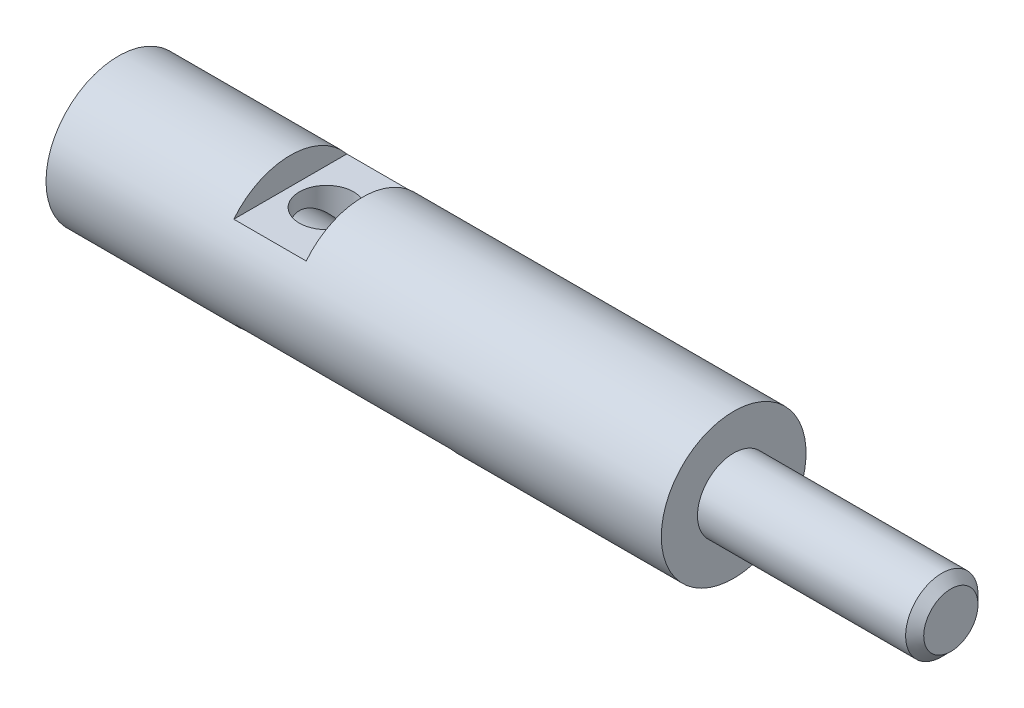
ISO-10303-21;
HEADER;
FILE_DESCRIPTION(('STEP AP214'),'2;1');
FILE_NAME('part.step','',(''),(''),'','','');
FILE_SCHEMA(('AUTOMOTIVE_DESIGN { 1 0 10303 214 1 1 1 1 }'));
ENDSEC;
DATA;
#1=APPLICATION_CONTEXT('core data for automotive mechanical design processes');
#2=APPLICATION_PROTOCOL_DEFINITION('international standard','automotive_design',2000,#1);
#3=PRODUCT_CONTEXT('',#1,'mechanical');
#4=PRODUCT('Part','Part','',(#3));
#5=PRODUCT_RELATED_PRODUCT_CATEGORY('part','',(#4));
#6=PRODUCT_DEFINITION_FORMATION('','',#4);
#7=PRODUCT_DEFINITION_CONTEXT('part definition',#1,'design');
#8=PRODUCT_DEFINITION('design','',#6,#7);
#9=PRODUCT_DEFINITION_SHAPE('','',#8);
#10=(LENGTH_UNIT() NAMED_UNIT(*) SI_UNIT(.MILLI.,.METRE.));
#11=(NAMED_UNIT(*) PLANE_ANGLE_UNIT() SI_UNIT($,.RADIAN.));
#12=(NAMED_UNIT(*) SI_UNIT($,.STERADIAN.) SOLID_ANGLE_UNIT());
#13=UNCERTAINTY_MEASURE_WITH_UNIT(LENGTH_MEASURE(1.E-05),#10,'distance_accuracy_value','');
#14=(GEOMETRIC_REPRESENTATION_CONTEXT(3) GLOBAL_UNCERTAINTY_ASSIGNED_CONTEXT((#13)) GLOBAL_UNIT_ASSIGNED_CONTEXT((#10,
#11,#12)) REPRESENTATION_CONTEXT('',''));
#15=CARTESIAN_POINT('',(0.,0.,0.));
#16=DIRECTION('',(0.,0.,1.));
#17=DIRECTION('',(1.,0.,0.));
#18=AXIS2_PLACEMENT_3D('',#15,#16,#17);
#19=CARTESIAN_POINT('',(0.,0.,0.));
#20=DIRECTION('',(-1.,0.,0.));
#21=DIRECTION('',(0.,0.,1.));
#22=AXIS2_PLACEMENT_3D('',#19,#20,#21);
#23=CYLINDRICAL_SURFACE('',#22,4.);
#24=CARTESIAN_POINT('',(9.5,0.,0.));
#25=DIRECTION('',(1.,0.,0.));
#26=DIRECTION('',(0.,0.,-1.));
#27=AXIS2_PLACEMENT_3D('',#24,#25,#26);
#28=CIRCLE('',#27,4.);
#29=CARTESIAN_POINT('',(9.5,2.5,-3.1224989991992));
#30=VERTEX_POINT('',#29);
#31=CARTESIAN_POINT('',(9.5,2.5,3.1224989991992));
#32=VERTEX_POINT('',#31);
#33=EDGE_CURVE('E126',#30,#32,#28,.T.);
#34=ORIENTED_EDGE('',*,*,#33,.F.);
#35=DIRECTION('',(-1.,0.,0.));
#36=VECTOR('',#35,1.);
#37=CARTESIAN_POINT('',(0.,2.5,-3.1224989991992));
#38=LINE('',#37,#36);
#39=CARTESIAN_POINT('',(13.5,2.5,-3.1224989991992));
#40=VERTEX_POINT('',#39);
#41=EDGE_CURVE('E124',#40,#30,#38,.T.);
#42=ORIENTED_EDGE('',*,*,#41,.F.);
#43=CARTESIAN_POINT('',(13.5,0.,0.));
#44=DIRECTION('',(-1.,0.,0.));
#45=DIRECTION('',(0.,0.,1.));
#46=AXIS2_PLACEMENT_3D('',#43,#44,#45);
#47=CIRCLE('',#46,4.);
#48=CARTESIAN_POINT('',(13.5,2.5,3.1224989991992));
#49=VERTEX_POINT('',#48);
#50=EDGE_CURVE('E120',#49,#40,#47,.T.);
#51=ORIENTED_EDGE('',*,*,#50,.F.);
#52=DIRECTION('',(-1.,0.,0.));
#53=VECTOR('',#52,1.);
#54=CARTESIAN_POINT('',(0.,2.5,3.1224989991992));
#55=LINE('',#54,#53);
#56=EDGE_CURVE('E122',#32,#49,#55,.F.);
#57=ORIENTED_EDGE('',*,*,#56,.F.);
#58=EDGE_LOOP('',(#34,#42,#51,#57));
#59=FACE_BOUND('',#58,.T.);
#60=CARTESIAN_POINT('',(0.,0.,0.));
#61=DIRECTION('',(-1.,0.,0.));
#62=DIRECTION('',(0.,0.,1.));
#63=AXIS2_PLACEMENT_3D('',#60,#61,#62);
#64=CIRCLE('',#63,4.);
#65=CARTESIAN_POINT('',(0.,0.,4.));
#66=VERTEX_POINT('',#65);
#67=EDGE_CURVE('E117',#66,#66,#64,.T.);
#68=ORIENTED_EDGE('',*,*,#67,.F.);
#69=EDGE_LOOP('',(#68));
#70=FACE_BOUND('',#69,.T.);
#71=CARTESIAN_POINT('',(34.,0.,0.));
#72=DIRECTION('',(-1.,0.,0.));
#73=DIRECTION('',(0.,0.,1.));
#74=AXIS2_PLACEMENT_3D('',#71,#72,#73);
#75=CIRCLE('',#74,4.);
#76=CARTESIAN_POINT('',(34.,0.,4.));
#77=VERTEX_POINT('',#76);
#78=EDGE_CURVE('E114',#77,#77,#75,.T.);
#79=ORIENTED_EDGE('',*,*,#78,.T.);
#80=EDGE_LOOP('',(#79));
#81=FACE_BOUND('',#80,.T.);
#82=DIRECTION('',(-1.,0.,0.));
#83=VECTOR('',#82,1.);
#84=CARTESIAN_POINT('',(0.,-2.5,3.1224989991992));
#85=LINE('',#84,#83);
#86=CARTESIAN_POINT('',(21.5,-2.5,3.1224989991992));
#87=VERTEX_POINT('',#86);
#88=CARTESIAN_POINT('',(9.5,-2.5,3.1224989991992));
#89=VERTEX_POINT('',#88);
#90=EDGE_CURVE('E11',#87,#89,#85,.T.);
#91=ORIENTED_EDGE('',*,*,#90,.F.);
#92=CARTESIAN_POINT('',(21.5,0.,0.));
#93=DIRECTION('',(-1.,0.,0.));
#94=DIRECTION('',(0.,0.,1.));
#95=AXIS2_PLACEMENT_3D('',#92,#93,#94);
#96=CIRCLE('',#95,4.);
#97=CARTESIAN_POINT('',(21.5,-2.5,-3.1224989991992));
#98=VERTEX_POINT('',#97);
#99=EDGE_CURVE('E130',#98,#87,#96,.T.);
#100=ORIENTED_EDGE('',*,*,#99,.F.);
#101=DIRECTION('',(-1.,0.,0.));
#102=VECTOR('',#101,1.);
#103=CARTESIAN_POINT('',(0.,-2.5,-3.1224989991992));
#104=LINE('',#103,#102);
#105=CARTESIAN_POINT('',(9.5,-2.5,-3.1224989991992));
#106=VERTEX_POINT('',#105);
#107=EDGE_CURVE('E128',#106,#98,#104,.F.);
#108=ORIENTED_EDGE('',*,*,#107,.F.);
#109=CARTESIAN_POINT('',(9.5,0.,0.));
#110=DIRECTION('',(1.,0.,0.));
#111=DIRECTION('',(0.,0.,-1.));
#112=AXIS2_PLACEMENT_3D('',#109,#110,#111);
#113=CIRCLE('',#112,4.);
#114=EDGE_CURVE('E47',#89,#106,#113,.T.);
#115=ORIENTED_EDGE('',*,*,#114,.F.);
#116=EDGE_LOOP('',(#91,#100,#108,#115));
#117=FACE_BOUND('',#116,.T.);
#118=ADVANCED_FACE('F39',(#59,#70,#81,#117),#23,.T.);
#119=CARTESIAN_POINT('',(0.,0.,0.));
#120=DIRECTION('',(1.,0.,0.));
#121=DIRECTION('',(0.,0.,-1.));
#122=AXIS2_PLACEMENT_3D('',#119,#120,#121);
#123=PLANE('',#122);
#124=CARTESIAN_POINT('',(0.,0.,0.));
#125=DIRECTION('',(-1.,0.,0.));
#126=DIRECTION('',(0.,0.,1.));
#127=AXIS2_PLACEMENT_3D('',#124,#125,#126);
#128=CIRCLE('',#127,1.6);
#129=CARTESIAN_POINT('',(0.,0.,1.6));
#130=VERTEX_POINT('',#129);
#131=EDGE_CURVE('E90',#130,#130,#128,.T.);
#132=ORIENTED_EDGE('',*,*,#131,.F.);
#133=EDGE_LOOP('',(#132));
#134=FACE_BOUND('',#133,.T.);
#135=ORIENTED_EDGE('',*,*,#67,.T.);
#136=EDGE_LOOP('',(#135));
#137=FACE_BOUND('',#136,.T.);
#138=ADVANCED_FACE('F41',(#134,#137),#123,.F.);
#139=CARTESIAN_POINT('',(34.,4.,0.));
#140=DIRECTION('',(-1.,0.,0.));
#141=DIRECTION('',(0.,0.,1.));
#142=AXIS2_PLACEMENT_3D('',#139,#140,#141);
#143=PLANE('',#142);
#144=ORIENTED_EDGE('',*,*,#78,.F.);
#145=EDGE_LOOP('',(#144));
#146=FACE_BOUND('',#145,.T.);
#147=CARTESIAN_POINT('',(34.,0.,0.));
#148=DIRECTION('',(-1.,0.,0.));
#149=DIRECTION('',(0.,0.,1.));
#150=AXIS2_PLACEMENT_3D('',#147,#148,#149);
#151=CIRCLE('',#150,2.);
#152=CARTESIAN_POINT('',(34.,0.,2.));
#153=VERTEX_POINT('',#152);
#154=EDGE_CURVE('E111',#153,#153,#151,.T.);
#155=ORIENTED_EDGE('',*,*,#154,.T.);
#156=EDGE_LOOP('',(#155));
#157=FACE_BOUND('',#156,.T.);
#158=ADVANCED_FACE('F157',(#146,#157),#143,.F.);
#159=CARTESIAN_POINT('',(0.,0.,0.));
#160=DIRECTION('',(-1.,0.,0.));
#161=DIRECTION('',(0.,0.,1.));
#162=AXIS2_PLACEMENT_3D('',#159,#160,#161);
#163=CYLINDRICAL_SURFACE('',#162,2.);
#164=ORIENTED_EDGE('',*,*,#154,.F.);
#165=EDGE_LOOP('',(#164));
#166=FACE_BOUND('',#165,.T.);
#167=CARTESIAN_POINT('',(45.5,0.,0.));
#168=DIRECTION('',(-1.,0.,0.));
#169=DIRECTION('',(0.,0.,1.));
#170=AXIS2_PLACEMENT_3D('',#167,#168,#169);
#171=CIRCLE('',#170,2.);
#172=CARTESIAN_POINT('',(45.5,0.,2.));
#173=VERTEX_POINT('',#172);
#174=EDGE_CURVE('E108',#173,#173,#171,.T.);
#175=ORIENTED_EDGE('',*,*,#174,.T.);
#176=EDGE_LOOP('',(#175));
#177=FACE_BOUND('',#176,.T.);
#178=ADVANCED_FACE('F164',(#166,#177),#163,.T.);
#179=CARTESIAN_POINT('',(46.,0.,0.));
#180=DIRECTION('',(-1.,0.,0.));
#181=DIRECTION('',(0.,0.,1.));
#182=AXIS2_PLACEMENT_3D('',#179,#180,#181);
#183=CONICAL_SURFACE('',#182,1.5,0.785398163397448);
#184=ORIENTED_EDGE('',*,*,#174,.F.);
#185=EDGE_LOOP('',(#184));
#186=FACE_BOUND('',#185,.T.);
#187=CARTESIAN_POINT('',(46.,0.,0.));
#188=DIRECTION('',(-1.,0.,0.));
#189=DIRECTION('',(0.,0.,1.));
#190=AXIS2_PLACEMENT_3D('',#187,#188,#189);
#191=CIRCLE('',#190,1.5);
#192=CARTESIAN_POINT('',(46.,0.,1.5));
#193=VERTEX_POINT('',#192);
#194=EDGE_CURVE('E102',#193,#193,#191,.T.);
#195=ORIENTED_EDGE('',*,*,#194,.T.);
#196=EDGE_LOOP('',(#195));
#197=FACE_BOUND('',#196,.T.);
#198=ADVANCED_FACE('F168',(#186,#197),#183,.T.);
#199=CARTESIAN_POINT('',(46.,1.5,0.));
#200=DIRECTION('',(-1.,0.,0.));
#201=DIRECTION('',(0.,0.,1.));
#202=AXIS2_PLACEMENT_3D('',#199,#200,#201);
#203=PLANE('',#202);
#204=ORIENTED_EDGE('',*,*,#194,.F.);
#205=EDGE_LOOP('',(#204));
#206=FACE_BOUND('',#205,.T.);
#207=ADVANCED_FACE('F172',(#206),#203,.F.);
#208=CARTESIAN_POINT('',(9.5,2.5,4.));
#209=DIRECTION('',(1.,0.,0.));
#210=DIRECTION('',(0.,0.,-1.));
#211=AXIS2_PLACEMENT_3D('',#208,#209,#210);
#212=PLANE('',#211);
#213=ORIENTED_EDGE('',*,*,#33,.T.);
#214=DIRECTION('',(0.,0.,-1.));
#215=VECTOR('',#214,1.);
#216=CARTESIAN_POINT('',(9.5,2.5,4.));
#217=LINE('',#216,#215);
#218=EDGE_CURVE('E92',#32,#30,#217,.T.);
#219=ORIENTED_EDGE('',*,*,#218,.T.);
#220=EDGE_LOOP('',(#213,#219));
#221=FACE_BOUND('',#220,.T.);
#222=ADVANCED_FACE('F175',(#221),#212,.T.);
#223=CARTESIAN_POINT('',(9.5,2.5,4.));
#224=DIRECTION('',(0.,1.,0.));
#225=DIRECTION('',(0.,0.,1.));
#226=AXIS2_PLACEMENT_3D('',#223,#224,#225);
#227=PLANE('',#226);
#228=CARTESIAN_POINT('',(11.5,2.5,0.));
#229=DIRECTION('',(0.,1.,0.));
#230=DIRECTION('',(0.,0.,1.));
#231=AXIS2_PLACEMENT_3D('',#228,#229,#230);
#232=CIRCLE('',#231,1.5);
#233=CARTESIAN_POINT('',(11.5,2.5,1.5));
#234=VERTEX_POINT('',#233);
#235=EDGE_CURVE('E234',#234,#234,#232,.T.);
#236=ORIENTED_EDGE('',*,*,#235,.F.);
#237=EDGE_LOOP('',(#236));
#238=FACE_BOUND('',#237,.T.);
#239=ORIENTED_EDGE('',*,*,#41,.T.);
#240=ORIENTED_EDGE('',*,*,#218,.F.);
#241=ORIENTED_EDGE('',*,*,#56,.T.);
#242=DIRECTION('',(0.,0.,-1.));
#243=VECTOR('',#242,1.);
#244=CARTESIAN_POINT('',(13.5,2.5,4.));
#245=LINE('',#244,#243);
#246=EDGE_CURVE('E60',#49,#40,#245,.T.);
#247=ORIENTED_EDGE('',*,*,#246,.T.);
#248=EDGE_LOOP('',(#239,#240,#241,#247));
#249=FACE_BOUND('',#248,.T.);
#250=ADVANCED_FACE('F178',(#238,#249),#227,.T.);
#251=CARTESIAN_POINT('',(13.5,2.5,4.));
#252=DIRECTION('',(-1.,0.,0.));
#253=DIRECTION('',(0.,0.,1.));
#254=AXIS2_PLACEMENT_3D('',#251,#252,#253);
#255=PLANE('',#254);
#256=ORIENTED_EDGE('',*,*,#50,.T.);
#257=ORIENTED_EDGE('',*,*,#246,.F.);
#258=EDGE_LOOP('',(#256,#257));
#259=FACE_BOUND('',#258,.T.);
#260=ADVANCED_FACE('F148',(#259),#255,.T.);
#261=CARTESIAN_POINT('',(9.5,-2.5,4.));
#262=DIRECTION('',(1.,0.,0.));
#263=DIRECTION('',(0.,0.,-1.));
#264=AXIS2_PLACEMENT_3D('',#261,#262,#263);
#265=PLANE('',#264);
#266=ORIENTED_EDGE('',*,*,#114,.T.);
#267=DIRECTION('',(0.,0.,-1.));
#268=VECTOR('',#267,1.);
#269=CARTESIAN_POINT('',(9.5,-2.5,4.));
#270=LINE('',#269,#268);
#271=EDGE_CURVE('E53',#89,#106,#270,.T.);
#272=ORIENTED_EDGE('',*,*,#271,.F.);
#273=EDGE_LOOP('',(#266,#272));
#274=FACE_BOUND('',#273,.T.);
#275=ADVANCED_FACE('F134',(#274),#265,.T.);
#276=CARTESIAN_POINT('',(21.5,-2.5,4.));
#277=DIRECTION('',(-1.,0.,0.));
#278=DIRECTION('',(0.,0.,1.));
#279=AXIS2_PLACEMENT_3D('',#276,#277,#278);
#280=PLANE('',#279);
#281=ORIENTED_EDGE('',*,*,#99,.T.);
#282=DIRECTION('',(0.,0.,-1.));
#283=VECTOR('',#282,1.);
#284=CARTESIAN_POINT('',(21.5,-2.5,4.));
#285=LINE('',#284,#283);
#286=EDGE_CURVE('E100',#87,#98,#285,.T.);
#287=ORIENTED_EDGE('',*,*,#286,.T.);
#288=EDGE_LOOP('',(#281,#287));
#289=FACE_BOUND('',#288,.T.);
#290=ADVANCED_FACE('F140',(#289),#280,.T.);
#291=CARTESIAN_POINT('',(9.5,-2.5,4.));
#292=DIRECTION('',(0.,-1.,0.));
#293=DIRECTION('',(0.,0.,-1.));
#294=AXIS2_PLACEMENT_3D('',#291,#292,#293);
#295=PLANE('',#294);
#296=ORIENTED_EDGE('',*,*,#90,.T.);
#297=ORIENTED_EDGE('',*,*,#271,.T.);
#298=ORIENTED_EDGE('',*,*,#107,.T.);
#299=ORIENTED_EDGE('',*,*,#286,.F.);
#300=EDGE_LOOP('',(#296,#297,#298,#299));
#301=FACE_BOUND('',#300,.T.);
#302=ADVANCED_FACE('F84',(#301),#295,.T.);
#303=CARTESIAN_POINT('',(14.,0.,0.));
#304=DIRECTION('',(-1.,0.,0.));
#305=DIRECTION('',(0.,0.,1.));
#306=AXIS2_PLACEMENT_3D('',#303,#304,#305);
#307=CONICAL_SURFACE('',#306,1.6,1.02974425867665);
#308=CARTESIAN_POINT('',(14.9613769904441,0.,0.));
#309=VERTEX_POINT('',#308);
#310=VERTEX_LOOP('',#309);
#311=FACE_BOUND('',#310,.T.);
#312=CARTESIAN_POINT('',(14.,0.,0.));
#313=DIRECTION('',(-1.,0.,0.));
#314=DIRECTION('',(0.,0.,1.));
#315=AXIS2_PLACEMENT_3D('',#312,#313,#314);
#316=CIRCLE('',#315,1.6);
#317=CARTESIAN_POINT('',(14.,0.,1.6));
#318=VERTEX_POINT('',#317);
#319=EDGE_CURVE('E88',#318,#318,#316,.T.);
#320=ORIENTED_EDGE('',*,*,#319,.T.);
#321=EDGE_LOOP('',(#320));
#322=FACE_BOUND('',#321,.T.);
#323=ADVANCED_FACE('F80',(#311,#322),#307,.F.);
#324=CARTESIAN_POINT('',(0.,0.,0.));
#325=DIRECTION('',(-1.,0.,0.));
#326=DIRECTION('',(0.,0.,1.));
#327=AXIS2_PLACEMENT_3D('',#324,#325,#326);
#328=CYLINDRICAL_SURFACE('',#327,1.6);
#329=CARTESIAN_POINT('',(11.5,0.556776436282993,1.5));
#330=CARTESIAN_POINT('',(11.4608142814035,0.556794360307968,1.49999591748038));
#331=CARTESIAN_POINT('',(11.4215648187872,0.561044818005708,1.49843522559346));
#332=CARTESIAN_POINT('',(11.3447149063999,0.57677099860918,1.49244676287404));
#333=CARTESIAN_POINT('',(11.3071248952745,0.588286957962551,1.48800302176562));
#334=CARTESIAN_POINT('',(11.2139921009811,0.623719616327508,1.47360085341389));
#335=CARTESIAN_POINT('',(11.1600475830992,0.650971784013963,1.46195096807718));
#336=CARTESIAN_POINT('',(11.0564091541335,0.710622919731777,1.43391850703445));
#337=CARTESIAN_POINT('',(11.0067334600684,0.743042408449403,1.4175168390555));
#338=CARTESIAN_POINT('',(10.9111788912353,0.809669158095606,1.38053371899763));
#339=CARTESIAN_POINT('',(10.8652622967479,0.843850970278858,1.36000358385786));
#340=CARTESIAN_POINT('',(10.7760653813882,0.912847778038635,1.31469444042558));
#341=CARTESIAN_POINT('',(10.7327871776788,0.947663253747807,1.28991207923037));
#342=CARTESIAN_POINT('',(10.6067588283323,1.05146267100393,1.20916432834585));
#343=CARTESIAN_POINT('',(10.5275721871828,1.11998237999355,1.146703710984));
#344=CARTESIAN_POINT('',(10.400142824234,1.232515344475,1.02271923249059));
#345=CARTESIAN_POINT('',(10.3492761000822,1.27819470502895,0.965377618728455));
#346=CARTESIAN_POINT('',(10.2552676833879,1.3634355719266,0.840664900623474));
#347=CARTESIAN_POINT('',(10.2121126643547,1.40300761577933,0.773311473976305));
#348=CARTESIAN_POINT('',(10.1437203215739,1.46607021232606,0.643963480774505));
#349=CARTESIAN_POINT('',(10.1166231697647,1.4911938647193,0.583755998073612));
#350=CARTESIAN_POINT('',(10.0700832507878,1.53446652026934,0.458059363442053));
#351=CARTESIAN_POINT('',(10.0506360300147,1.55261958138901,0.392573311405422));
#352=CARTESIAN_POINT('',(10.0206046864233,1.58069032041111,0.257326083662312));
#353=CARTESIAN_POINT('',(10.010085922127,1.59054726432286,0.187537326745419));
#354=CARTESIAN_POINT('',(9.99905627903529,1.60088350783196,0.0464918125339085));
#355=CARTESIAN_POINT('',(9.99853975582738,1.60136809638785,-0.0247640940966203));
#356=CARTESIAN_POINT('',(10.007005452095,1.59343382568127,-0.157736549752929));
#357=CARTESIAN_POINT('',(10.0148815337016,1.5860517756257,-0.219592366952554));
#358=CARTESIAN_POINT('',(10.0379034574042,1.5645158412841,-0.340696569030931));
#359=CARTESIAN_POINT('',(10.0530502550246,1.55036106692102,-0.399944610075675));
#360=CARTESIAN_POINT('',(10.0903203383489,1.51563493876985,-0.516391689853705));
#361=CARTESIAN_POINT('',(10.1126472619071,1.49487650971999,-0.573468442197487));
#362=CARTESIAN_POINT('',(10.1630361972434,1.4482341941657,-0.682755818026341));
#363=CARTESIAN_POINT('',(10.1911011665192,1.42234766475591,-0.734963911825116));
#364=CARTESIAN_POINT('',(10.267843992373,1.35198379933556,-0.860015338483145));
#365=CARTESIAN_POINT('',(10.3196467476024,1.30484385304296,-0.929452181151889));
#366=CARTESIAN_POINT('',(10.4315885764439,1.20452709782384,-1.05626118683588));
#367=CARTESIAN_POINT('',(10.4917489292963,1.15133494402957,-1.1136015816024));
#368=CARTESIAN_POINT('',(10.6204050456706,1.0404588252606,-1.21793057162936));
#369=CARTESIAN_POINT('',(10.6890723666065,0.982695545154262,-1.26462261332804));
#370=CARTESIAN_POINT('',(10.797156737006,0.896400246708988,-1.32578864668944));
#371=CARTESIAN_POINT('',(10.8340165502546,0.867704668630933,-1.3446929426724));
#372=CARTESIAN_POINT('',(10.909657452839,0.811091036033491,-1.37957668187661));
#373=CARTESIAN_POINT('',(10.9484374594731,0.783172556912583,-1.39555775002596));
#374=CARTESIAN_POINT('',(11.0269663242117,0.7300348333484,-1.42405294767729));
#375=CARTESIAN_POINT('',(11.0666389929397,0.704756446938294,-1.43666542712608));
#376=CARTESIAN_POINT('',(11.1487409979602,0.657458134852926,-1.45891248428436));
#377=CARTESIAN_POINT('',(11.1911684906943,0.635436061710262,-1.46854902916382));
#378=CARTESIAN_POINT('',(11.2669198114037,0.602923921462716,-1.48212800618862));
#379=CARTESIAN_POINT('',(11.2994276307461,0.590933673151382,-1.48690999896823));
#380=CARTESIAN_POINT('',(11.3660256360822,0.571787904059266,-1.4943780658291));
#381=CARTESIAN_POINT('',(11.4001097950903,0.564615371353666,-1.49707152004778));
#382=CARTESIAN_POINT('',(11.4696019819567,0.556533644450708,-1.5000979785989));
#383=CARTESIAN_POINT('',(11.5050211329262,0.55570252296125,-1.50040156130741));
#384=CARTESIAN_POINT('',(11.5753281049843,0.56074540305912,-1.49852224877674));
#385=CARTESIAN_POINT('',(11.6102149294836,0.566630712718364,-1.49633516014947));
#386=CARTESIAN_POINT('',(11.6874642838351,0.585987747436437,-1.48887399471504));
#387=CARTESIAN_POINT('',(11.7293353056799,0.601065676571955,-1.48293152579866));
#388=CARTESIAN_POINT('',(11.8103488262129,0.636374769930758,-1.46812610485829));
#389=CARTESIAN_POINT('',(11.8494780108795,0.656629121488803,-1.45924995779248));
#390=CARTESIAN_POINT('',(11.9286883866387,0.701875957011584,-1.43807094680483));
#391=CARTESIAN_POINT('',(11.9685557801113,0.727127447111406,-1.42553699648588));
#392=CARTESIAN_POINT('',(12.0461206878631,0.779381216672934,-1.39765829599652));
#393=CARTESIAN_POINT('',(12.0838158612587,0.806385320599637,-1.38231058538122));
#394=CARTESIAN_POINT('',(12.1942716286052,0.88856580262675,-1.33212338501918));
#395=CARTESIAN_POINT('',(12.2643494942095,0.944876404979527,-1.29315455355403));
#396=CARTESIAN_POINT('',(12.4070102612594,1.0634646620204,-1.19816335169158));
#397=CARTESIAN_POINT('',(12.4787093195869,1.12555244106212,-1.14057168012524));
#398=CARTESIAN_POINT('',(12.6126229061813,1.24376611252867,-1.01031877199258));
#399=CARTESIAN_POINT('',(12.6748631428275,1.29990803456029,-0.937699696936927));
#400=CARTESIAN_POINT('',(12.7691460088287,1.3858173860069,-0.802349359308852));
#401=CARTESIAN_POINT('',(12.804529772181,1.41832676541828,-0.743690415358165));
#402=CARTESIAN_POINT('',(12.8678968108623,1.4768181093869,-0.619444268612347));
#403=CARTESIAN_POINT('',(12.8958834817191,1.50280306860943,-0.553860264082384));
#404=CARTESIAN_POINT('',(12.9429745075586,1.54664191116038,-0.416132357085989));
#405=CARTESIAN_POINT('',(12.9619875230072,1.56441214386841,-0.343929571020695));
#406=CARTESIAN_POINT('',(12.9890656685531,1.58974621337112,-0.195778793134278));
#407=CARTESIAN_POINT('',(12.9971445082187,1.59732283112782,-0.119835615238093));
#408=CARTESIAN_POINT('',(13.0012600282823,1.60118142855586,0.0213844278402243));
#409=CARTESIAN_POINT('',(12.9988981990062,1.59896550128957,0.0865810741849408));
#410=CARTESIAN_POINT('',(12.9858658624273,1.58675521818546,0.215384979708259));
#411=CARTESIAN_POINT('',(12.9751951897881,1.57676070756285,0.278992207233274));
#412=CARTESIAN_POINT('',(12.9468317829084,1.55025729530819,0.400539625139138));
#413=CARTESIAN_POINT('',(12.9294164929961,1.53400591293725,0.458602779071038));
#414=CARTESIAN_POINT('',(12.8885182068959,1.49597032013067,0.57059303823956));
#415=CARTESIAN_POINT('',(12.8650335302936,1.4741845774404,0.624518992650244));
#416=CARTESIAN_POINT('',(12.8014892259495,1.41550764514737,0.75036307066007));
#417=CARTESIAN_POINT('',(12.7586820582305,1.37618659115258,0.819766297816115));
#418=CARTESIAN_POINT('',(12.6649063038062,1.29098055656234,0.94834557481918));
#419=CARTESIAN_POINT('',(12.6139151744602,1.24507748420787,1.00749240923513));
#420=CARTESIAN_POINT('',(12.4877804300114,1.13337313253742,1.13342217165851));
#421=CARTESIAN_POINT('',(12.4101952113046,1.0659777220133,1.19636468348739));
#422=CARTESIAN_POINT('',(12.28681882789,0.963626132389664,1.27802222267967));
#423=CARTESIAN_POINT('',(12.2445184180068,0.929292684294546,1.30311884655895));
#424=CARTESIAN_POINT('',(12.15739704707,0.861061187823702,1.34916941560523));
#425=CARTESIAN_POINT('',(12.1125779406219,0.827162841087271,1.37012635892997));
#426=CARTESIAN_POINT('',(12.0256626719191,0.765186331725715,1.40556193303025));
#427=CARTESIAN_POINT('',(11.9839070890098,0.736904357786033,1.42051992697615));
#428=CARTESIAN_POINT('',(11.8974972212146,0.683262384342935,1.44707949416911));
#429=CARTESIAN_POINT('',(11.8528455449479,0.657899810837872,1.45868403796629));
#430=CARTESIAN_POINT('',(11.773241528021,0.619536203933046,1.47529002940828));
#431=CARTESIAN_POINT('',(11.7392046628267,0.605079465217443,1.48123061340838));
#432=CARTESIAN_POINT('',(11.6691751987846,0.580995573994624,1.49084374250074));
#433=CARTESIAN_POINT('',(11.6331906589201,0.571349988908749,1.49452495643114));
#434=CARTESIAN_POINT('',(11.5806346808834,0.562364796796332,1.49791653162561));
#435=CARTESIAN_POINT('',(11.5645878072563,0.560281586776124,1.49869523729355));
#436=CARTESIAN_POINT('',(11.5323642214162,0.557483909896251,1.49973773738808));
#437=CARTESIAN_POINT('',(11.5161875496704,0.556769031900607,1.50000168648149));
#438=CARTESIAN_POINT('',(11.5,0.556776436282993,1.5));
#439=B_SPLINE_CURVE_WITH_KNOTS('',3,(#329,#330,#331,#332,#333,#334,#335,#336,#337,#338,#339,
#340,#341,#342,#343,#344,#345,#346,#347,#348,#349,#350,#351,#352,#353,#354,#355,#356,#357,#358,
#359,#360,#361,#362,#363,#364,#365,#366,#367,#368,#369,#370,#371,#372,#373,#374,#375,#376,#377,
#378,#379,#380,#381,#382,#383,#384,#385,#386,#387,#388,#389,#390,#391,#392,#393,#394,#395,#396,
#397,#398,#399,#400,#401,#402,#403,#404,#405,#406,#407,#408,#409,#410,#411,#412,#413,#414,#415,
#416,#417,#418,#419,#420,#421,#422,#423,#424,#425,#426,#427,#428,#429,#430,#431,#432,#433,#434,
#435,#436,#437,#438),.UNSPECIFIED.,.T.,.F.,(4,2,2,2,2,2,2,2,2,2,2,2,2,2,2,2,2,2,2,2,2,2,2,2,2,2,
2,2,2,2,2,2,2,2,2,2,2,2,2,2,2,2,2,2,2,2,2,2,2,2,2,2,2,2,4),(0.,0.117467589907524,
0.235591496886634,0.41919154861068,0.603539771072581,0.785724324058835,0.968053196290107,
1.33176639501296,1.59859725966633,1.8649624619968,2.07606795276693,2.28705036047585,
2.49956421012259,2.71195813156401,2.89945993597832,3.08698638880657,3.28038593318391,
3.47388541178764,3.7681180246498,4.06311400101066,4.36552771567756,4.51661541633714,
4.66761887528796,4.81355475017568,4.95939395014827,5.06401578057131,5.16826620902108,
5.27379808421623,5.37950789986953,5.51344673278505,5.6479963830486,5.79426226369868,
5.94068292772848,6.23371637533391,6.56531041609894,6.89598643869107,7.12267164549572,
7.34925261431568,7.57809261806568,7.80664542932907,8.00146215869703,8.19628276479113,
8.38381973308357,8.57140867995029,8.8414818893983,9.11231219966088,9.47181652636003,
9.65163562334725,9.83132400522414,9.9889663607854,10.1464686426564,10.2585582522236,
10.3702150586827,10.4187552951261,10.4672809446329),.UNSPECIFIED.);
#440=CARTESIAN_POINT('',(11.5,0.556776436282993,1.5));
#441=VERTEX_POINT('',#440);
#442=EDGE_CURVE('E95',#441,#441,#439,.T.);
#443=ORIENTED_EDGE('',*,*,#442,.F.);
#444=EDGE_LOOP('',(#443));
#445=FACE_BOUND('',#444,.T.);
#446=ORIENTED_EDGE('',*,*,#319,.F.);
#447=EDGE_LOOP('',(#446));
#448=FACE_BOUND('',#447,.T.);
#449=ORIENTED_EDGE('',*,*,#131,.T.);
#450=EDGE_LOOP('',(#449));
#451=FACE_BOUND('',#450,.T.);
#452=ADVANCED_FACE('F83',(#445,#448,#451),#328,.F.);
#453=CARTESIAN_POINT('',(11.5,-4.001,0.));
#454=DIRECTION('',(0.,1.,0.));
#455=DIRECTION('',(0.,0.,1.));
#456=AXIS2_PLACEMENT_3D('',#453,#454,#455);
#457=CYLINDRICAL_SURFACE('',#456,1.5);
#458=ORIENTED_EDGE('',*,*,#442,.T.);
#459=EDGE_LOOP('',(#458));
#460=FACE_BOUND('',#459,.T.);
#461=ORIENTED_EDGE('',*,*,#235,.T.);
#462=EDGE_LOOP('',(#461));
#463=FACE_BOUND('',#462,.T.);
#464=ADVANCED_FACE('F215',(#460,#463),#457,.F.);
#465=CLOSED_SHELL('',(#118,#138,#158,#178,#198,#207,#222,#250,#260,#275,#290,#302,#323,#452,#464));
#466=MANIFOLD_SOLID_BREP('B2',#465);
#467=ADVANCED_BREP_SHAPE_REPRESENTATION('',(#18,#466),#14);
#468=SHAPE_DEFINITION_REPRESENTATION(#9,#467);
ENDSEC;
END-ISO-10303-21;
